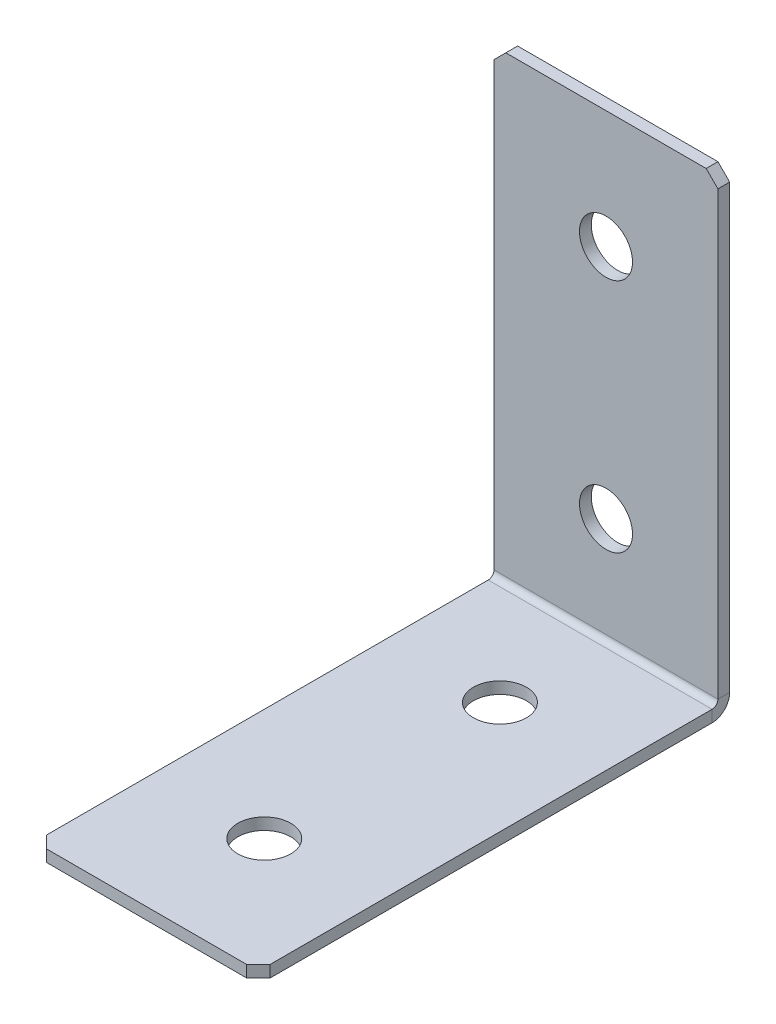
ISO-10303-21;
HEADER;
FILE_DESCRIPTION(('STEP AP214'),'2;1');
FILE_NAME('part.step','',(''),(''),'','','');
FILE_SCHEMA(('AUTOMOTIVE_DESIGN { 1 0 10303 214 1 1 1 1 }'));
ENDSEC;
DATA;
#1=APPLICATION_CONTEXT('core data for automotive mechanical design processes');
#2=APPLICATION_PROTOCOL_DEFINITION('international standard','automotive_design',2000,#1);
#3=PRODUCT_CONTEXT('',#1,'mechanical');
#4=PRODUCT('Part','Part','',(#3));
#5=PRODUCT_RELATED_PRODUCT_CATEGORY('part','',(#4));
#6=PRODUCT_DEFINITION_FORMATION('','',#4);
#7=PRODUCT_DEFINITION_CONTEXT('part definition',#1,'design');
#8=PRODUCT_DEFINITION('design','',#6,#7);
#9=PRODUCT_DEFINITION_SHAPE('','',#8);
#10=(LENGTH_UNIT() NAMED_UNIT(*) SI_UNIT(.MILLI.,.METRE.));
#11=(NAMED_UNIT(*) PLANE_ANGLE_UNIT() SI_UNIT($,.RADIAN.));
#12=(NAMED_UNIT(*) SI_UNIT($,.STERADIAN.) SOLID_ANGLE_UNIT());
#13=UNCERTAINTY_MEASURE_WITH_UNIT(LENGTH_MEASURE(1.E-05),#10,'distance_accuracy_value','');
#14=(GEOMETRIC_REPRESENTATION_CONTEXT(3) GLOBAL_UNCERTAINTY_ASSIGNED_CONTEXT((#13)) GLOBAL_UNIT_ASSIGNED_CONTEXT((#10,
#11,#12)) REPRESENTATION_CONTEXT('',''));
#15=CARTESIAN_POINT('',(0.,0.,0.));
#16=DIRECTION('',(0.,0.,1.));
#17=DIRECTION('',(1.,0.,0.));
#18=AXIS2_PLACEMENT_3D('',#15,#16,#17);
#19=CARTESIAN_POINT('',(0.,0.,2.));
#20=DIRECTION('',(0.,0.,-1.));
#21=DIRECTION('',(-1.,0.,0.));
#22=AXIS2_PLACEMENT_3D('',#19,#20,#21);
#23=PLANE('',#22);
#24=DIRECTION('',(0.,1.,0.));
#25=VECTOR('',#24,1.);
#26=CARTESIAN_POINT('',(19.,0.,2.));
#27=LINE('',#26,#25);
#28=CARTESIAN_POINT('',(19.,3.,2.));
#29=VERTEX_POINT('',#28);
#30=CARTESIAN_POINT('',(19.,78.,2.));
#31=VERTEX_POINT('',#30);
#32=EDGE_CURVE('E252',#29,#31,#27,.T.);
#33=ORIENTED_EDGE('',*,*,#32,.T.);
#34=DIRECTION('',(0.70710678118655,-0.707106781186545,0.));
#35=VECTOR('',#34,1.);
#36=CARTESIAN_POINT('',(19.,78.,2.));
#37=LINE('',#36,#35);
#38=CARTESIAN_POINT('',(17.,80.,2.));
#39=VERTEX_POINT('',#38);
#40=EDGE_CURVE('E301',#31,#39,#37,.F.);
#41=ORIENTED_EDGE('',*,*,#40,.T.);
#42=DIRECTION('',(-1.,0.,0.));
#43=VECTOR('',#42,1.);
#44=CARTESIAN_POINT('',(-19.,80.,2.));
#45=LINE('',#44,#43);
#46=CARTESIAN_POINT('',(-17.,80.,2.));
#47=VERTEX_POINT('',#46);
#48=EDGE_CURVE('E257',#39,#47,#45,.T.);
#49=ORIENTED_EDGE('',*,*,#48,.T.);
#50=DIRECTION('',(0.707106781186545,0.70710678118655,0.));
#51=VECTOR('',#50,1.);
#52=CARTESIAN_POINT('',(-17.,80.,2.));
#53=LINE('',#52,#51);
#54=CARTESIAN_POINT('',(-19.,78.,2.));
#55=VERTEX_POINT('',#54);
#56=EDGE_CURVE('E298',#47,#55,#53,.F.);
#57=ORIENTED_EDGE('',*,*,#56,.T.);
#58=DIRECTION('',(0.,-1.,0.));
#59=VECTOR('',#58,1.);
#60=CARTESIAN_POINT('',(-19.,0.,2.));
#61=LINE('',#60,#59);
#62=CARTESIAN_POINT('',(-19.,3.,2.));
#63=VERTEX_POINT('',#62);
#64=EDGE_CURVE('E249',#55,#63,#61,.T.);
#65=ORIENTED_EDGE('',*,*,#64,.T.);
#66=DIRECTION('',(1.,0.,0.));
#67=VECTOR('',#66,1.);
#68=CARTESIAN_POINT('',(19.,3.,2.));
#69=LINE('',#68,#67);
#70=EDGE_CURVE('E236',#29,#63,#69,.F.);
#71=ORIENTED_EDGE('',*,*,#70,.F.);
#72=EDGE_LOOP('',(#33,#41,#49,#57,#65,#71));
#73=FACE_BOUND('',#72,.T.);
#74=CARTESIAN_POINT('',(0.,60.,2.));
#75=DIRECTION('',(0.,0.,1.));
#76=DIRECTION('',(1.,0.,0.));
#77=AXIS2_PLACEMENT_3D('',#74,#75,#76);
#78=CIRCLE('',#77,4.5);
#79=CARTESIAN_POINT('',(4.5,60.,2.));
#80=VERTEX_POINT('',#79);
#81=EDGE_CURVE('E681',#80,#80,#78,.T.);
#82=ORIENTED_EDGE('',*,*,#81,.F.);
#83=EDGE_LOOP('',(#82));
#84=FACE_BOUND('',#83,.T.);
#85=CARTESIAN_POINT('',(0.,20.,2.));
#86=DIRECTION('',(0.,0.,1.));
#87=DIRECTION('',(1.,0.,0.));
#88=AXIS2_PLACEMENT_3D('',#85,#86,#87);
#89=CIRCLE('',#88,4.5);
#90=CARTESIAN_POINT('',(4.5,20.,2.));
#91=VERTEX_POINT('',#90);
#92=EDGE_CURVE('E664',#91,#91,#89,.T.);
#93=ORIENTED_EDGE('',*,*,#92,.F.);
#94=EDGE_LOOP('',(#93));
#95=FACE_BOUND('',#94,.T.);
#96=ADVANCED_FACE('F68',(#73,#84,#95),#23,.F.);
#97=CARTESIAN_POINT('',(19.,0.,2.));
#98=DIRECTION('',(-1.,0.,0.));
#99=DIRECTION('',(0.,1.,0.));
#100=AXIS2_PLACEMENT_3D('',#97,#98,#99);
#101=PLANE('',#100);
#102=DIRECTION('',(0.,1.,0.));
#103=VECTOR('',#102,1.);
#104=CARTESIAN_POINT('',(19.,0.,0.));
#105=LINE('',#104,#103);
#106=CARTESIAN_POINT('',(19.,3.,0.));
#107=VERTEX_POINT('',#106);
#108=CARTESIAN_POINT('',(19.,78.,0.));
#109=VERTEX_POINT('',#108);
#110=EDGE_CURVE('E264',#107,#109,#105,.T.);
#111=ORIENTED_EDGE('',*,*,#110,.T.);
#112=DIRECTION('',(0.,0.,-1.));
#113=VECTOR('',#112,1.);
#114=CARTESIAN_POINT('',(19.,78.,2.));
#115=LINE('',#114,#113);
#116=EDGE_CURVE('E294',#109,#31,#115,.F.);
#117=ORIENTED_EDGE('',*,*,#116,.T.);
#118=ORIENTED_EDGE('',*,*,#32,.F.);
#119=DIRECTION('',(0.,0.,-1.));
#120=VECTOR('',#119,1.);
#121=CARTESIAN_POINT('',(19.,3.,2.));
#122=LINE('',#121,#120);
#123=EDGE_CURVE('E231',#29,#107,#122,.T.);
#124=ORIENTED_EDGE('',*,*,#123,.T.);
#125=EDGE_LOOP('',(#111,#117,#118,#124));
#126=FACE_BOUND('',#125,.T.);
#127=ADVANCED_FACE('F322',(#126),#101,.F.);
#128=CARTESIAN_POINT('',(0.,0.,0.));
#129=DIRECTION('',(0.,0.,-1.));
#130=DIRECTION('',(-1.,0.,0.));
#131=AXIS2_PLACEMENT_3D('',#128,#129,#130);
#132=PLANE('',#131);
#133=CARTESIAN_POINT('',(0.,20.,0.));
#134=DIRECTION('',(0.,0.,-1.));
#135=DIRECTION('',(-1.,0.,0.));
#136=AXIS2_PLACEMENT_3D('',#133,#134,#135);
#137=CIRCLE('',#136,4.5);
#138=CARTESIAN_POINT('',(-4.5,20.,0.));
#139=VERTEX_POINT('',#138);
#140=EDGE_CURVE('E672',#139,#139,#137,.T.);
#141=ORIENTED_EDGE('',*,*,#140,.F.);
#142=EDGE_LOOP('',(#141));
#143=FACE_BOUND('',#142,.T.);
#144=CARTESIAN_POINT('',(0.,60.,0.));
#145=DIRECTION('',(0.,0.,-1.));
#146=DIRECTION('',(-1.,0.,0.));
#147=AXIS2_PLACEMENT_3D('',#144,#145,#146);
#148=CIRCLE('',#147,4.5);
#149=CARTESIAN_POINT('',(-4.5,60.,0.));
#150=VERTEX_POINT('',#149);
#151=EDGE_CURVE('E226',#150,#150,#148,.T.);
#152=ORIENTED_EDGE('',*,*,#151,.F.);
#153=EDGE_LOOP('',(#152));
#154=FACE_BOUND('',#153,.T.);
#155=DIRECTION('',(-1.,0.,0.));
#156=VECTOR('',#155,1.);
#157=CARTESIAN_POINT('',(0.,80.,0.));
#158=LINE('',#157,#156);
#159=CARTESIAN_POINT('',(17.,80.,0.));
#160=VERTEX_POINT('',#159);
#161=CARTESIAN_POINT('',(-17.,80.,0.));
#162=VERTEX_POINT('',#161);
#163=EDGE_CURVE('E253',#160,#162,#158,.T.);
#164=ORIENTED_EDGE('',*,*,#163,.F.);
#165=DIRECTION('',(-0.70710678118655,0.707106781186545,0.));
#166=VECTOR('',#165,1.);
#167=CARTESIAN_POINT('',(48.4999999999999,48.5000000000003,0.));
#168=LINE('',#167,#166);
#169=EDGE_CURVE('E78',#160,#109,#168,.F.);
#170=ORIENTED_EDGE('',*,*,#169,.T.);
#171=ORIENTED_EDGE('',*,*,#110,.F.);
#172=DIRECTION('',(1.,0.,0.));
#173=VECTOR('',#172,1.);
#174=CARTESIAN_POINT('',(19.,3.,0.));
#175=LINE('',#174,#173);
#176=CARTESIAN_POINT('',(-19.,3.00000000000001,0.));
#177=VERTEX_POINT('',#176);
#178=EDGE_CURVE('E167',#107,#177,#175,.F.);
#179=ORIENTED_EDGE('',*,*,#178,.T.);
#180=DIRECTION('',(0.,1.,0.));
#181=VECTOR('',#180,1.);
#182=CARTESIAN_POINT('',(-19.,0.,0.));
#183=LINE('',#182,#181);
#184=CARTESIAN_POINT('',(-19.,78.,0.));
#185=VERTEX_POINT('',#184);
#186=EDGE_CURVE('E246',#185,#177,#183,.F.);
#187=ORIENTED_EDGE('',*,*,#186,.F.);
#188=DIRECTION('',(-0.707106781186545,-0.70710678118655,0.));
#189=VECTOR('',#188,1.);
#190=CARTESIAN_POINT('',(-48.5,48.4999999999997,0.));
#191=LINE('',#190,#189);
#192=EDGE_CURVE('E90',#185,#162,#191,.F.);
#193=ORIENTED_EDGE('',*,*,#192,.T.);
#194=EDGE_LOOP('',(#164,#170,#171,#179,#187,#193));
#195=FACE_BOUND('',#194,.T.);
#196=ADVANCED_FACE('F317',(#143,#154,#195),#132,.T.);
#197=CARTESIAN_POINT('',(-19.,80.,2.));
#198=DIRECTION('',(0.,-1.,0.));
#199=DIRECTION('',(-1.,0.,0.));
#200=AXIS2_PLACEMENT_3D('',#197,#198,#199);
#201=PLANE('',#200);
#202=ORIENTED_EDGE('',*,*,#48,.F.);
#203=DIRECTION('',(0.,0.,1.));
#204=VECTOR('',#203,1.);
#205=CARTESIAN_POINT('',(17.,80.,2.));
#206=LINE('',#205,#204);
#207=EDGE_CURVE('E308',#39,#160,#206,.F.);
#208=ORIENTED_EDGE('',*,*,#207,.T.);
#209=ORIENTED_EDGE('',*,*,#163,.T.);
#210=DIRECTION('',(0.,0.,-1.));
#211=VECTOR('',#210,1.);
#212=CARTESIAN_POINT('',(-17.,80.,2.));
#213=LINE('',#212,#211);
#214=EDGE_CURVE('E304',#162,#47,#213,.F.);
#215=ORIENTED_EDGE('',*,*,#214,.T.);
#216=EDGE_LOOP('',(#202,#208,#209,#215));
#217=FACE_BOUND('',#216,.T.);
#218=ADVANCED_FACE('F330',(#217),#201,.F.);
#219=CARTESIAN_POINT('',(-19.,0.,2.));
#220=DIRECTION('',(1.,0.,0.));
#221=DIRECTION('',(0.,-1.,0.));
#222=AXIS2_PLACEMENT_3D('',#219,#220,#221);
#223=PLANE('',#222);
#224=ORIENTED_EDGE('',*,*,#64,.F.);
#225=DIRECTION('',(0.,0.,1.));
#226=VECTOR('',#225,1.);
#227=CARTESIAN_POINT('',(-19.,78.,2.));
#228=LINE('',#227,#226);
#229=EDGE_CURVE('E13',#55,#185,#228,.F.);
#230=ORIENTED_EDGE('',*,*,#229,.T.);
#231=ORIENTED_EDGE('',*,*,#186,.T.);
#232=DIRECTION('',(0.,0.,-1.));
#233=VECTOR('',#232,1.);
#234=CARTESIAN_POINT('',(-19.,3.,2.));
#235=LINE('',#234,#233);
#236=EDGE_CURVE('E242',#63,#177,#235,.T.);
#237=ORIENTED_EDGE('',*,*,#236,.F.);
#238=EDGE_LOOP('',(#224,#230,#231,#237));
#239=FACE_BOUND('',#238,.T.);
#240=ADVANCED_FACE('F334',(#239),#223,.F.);
#241=CARTESIAN_POINT('',(-19.,3.,3.));
#242=DIRECTION('',(-1.,0.,0.));
#243=DIRECTION('',(0.,0.,1.));
#244=AXIS2_PLACEMENT_3D('',#241,#242,#243);
#245=PLANE('',#244);
#246=DIRECTION('',(0.,1.,0.));
#247=VECTOR('',#246,1.);
#248=CARTESIAN_POINT('',(-19.,0.,2.99999999999999));
#249=LINE('',#248,#247);
#250=CARTESIAN_POINT('',(-19.,2.,3.));
#251=VERTEX_POINT('',#250);
#252=CARTESIAN_POINT('',(-19.,0.,2.99999999999999));
#253=VERTEX_POINT('',#252);
#254=EDGE_CURVE('E222',#251,#253,#249,.F.);
#255=ORIENTED_EDGE('',*,*,#254,.F.);
#256=CARTESIAN_POINT('',(-19.,3.,3.));
#257=DIRECTION('',(1.,0.,0.));
#258=DIRECTION('',(0.,0.,-1.));
#259=AXIS2_PLACEMENT_3D('',#256,#257,#258);
#260=CIRCLE('',#259,1.);
#261=EDGE_CURVE('E171',#63,#251,#260,.F.);
#262=ORIENTED_EDGE('',*,*,#261,.F.);
#263=ORIENTED_EDGE('',*,*,#236,.T.);
#264=CARTESIAN_POINT('',(-19.,3.,3.));
#265=DIRECTION('',(1.,0.,0.));
#266=DIRECTION('',(0.,0.,-1.));
#267=AXIS2_PLACEMENT_3D('',#264,#265,#266);
#268=CIRCLE('',#267,3.);
#269=EDGE_CURVE('E229',#177,#253,#268,.F.);
#270=ORIENTED_EDGE('',*,*,#269,.T.);
#271=EDGE_LOOP('',(#255,#262,#263,#270));
#272=FACE_BOUND('',#271,.T.);
#273=ADVANCED_FACE('F338',(#272),#245,.T.);
#274=CARTESIAN_POINT('',(19.,3.,3.));
#275=DIRECTION('',(-1.,0.,0.));
#276=DIRECTION('',(0.,0.,1.));
#277=AXIS2_PLACEMENT_3D('',#274,#275,#276);
#278=PLANE('',#277);
#279=CARTESIAN_POINT('',(19.,3.,3.));
#280=DIRECTION('',(1.,0.,0.));
#281=DIRECTION('',(0.,0.,-1.));
#282=AXIS2_PLACEMENT_3D('',#279,#280,#281);
#283=CIRCLE('',#282,1.);
#284=CARTESIAN_POINT('',(19.,2.,3.));
#285=VERTEX_POINT('',#284);
#286=EDGE_CURVE('E178',#285,#29,#283,.T.);
#287=ORIENTED_EDGE('',*,*,#286,.F.);
#288=DIRECTION('',(0.,1.,0.));
#289=VECTOR('',#288,1.);
#290=CARTESIAN_POINT('',(19.,2.,3.));
#291=LINE('',#290,#289);
#292=CARTESIAN_POINT('',(19.,0.,2.99999999999999));
#293=VERTEX_POINT('',#292);
#294=EDGE_CURVE('E175',#285,#293,#291,.F.);
#295=ORIENTED_EDGE('',*,*,#294,.T.);
#296=CARTESIAN_POINT('',(19.,3.,3.));
#297=DIRECTION('',(1.,0.,0.));
#298=DIRECTION('',(0.,0.,-1.));
#299=AXIS2_PLACEMENT_3D('',#296,#297,#298);
#300=CIRCLE('',#299,3.);
#301=EDGE_CURVE('E159',#293,#107,#300,.T.);
#302=ORIENTED_EDGE('',*,*,#301,.T.);
#303=ORIENTED_EDGE('',*,*,#123,.F.);
#304=EDGE_LOOP('',(#287,#295,#302,#303));
#305=FACE_BOUND('',#304,.T.);
#306=ADVANCED_FACE('F176',(#305),#278,.F.);
#307=CARTESIAN_POINT('',(19.,3.,3.));
#308=DIRECTION('',(1.,0.,0.));
#309=DIRECTION('',(0.,-1.,0.));
#310=AXIS2_PLACEMENT_3D('',#307,#308,#309);
#311=CYLINDRICAL_SURFACE('',#310,3.);
#312=ORIENTED_EDGE('',*,*,#178,.F.);
#313=ORIENTED_EDGE('',*,*,#301,.F.);
#314=DIRECTION('',(1.,0.,0.));
#315=VECTOR('',#314,1.);
#316=CARTESIAN_POINT('',(-19.,0.,2.99999999999999));
#317=LINE('',#316,#315);
#318=EDGE_CURVE('E164',#293,#253,#317,.F.);
#319=ORIENTED_EDGE('',*,*,#318,.T.);
#320=ORIENTED_EDGE('',*,*,#269,.F.);
#321=EDGE_LOOP('',(#312,#313,#319,#320));
#322=FACE_BOUND('',#321,.T.);
#323=ADVANCED_FACE('F161',(#322),#311,.T.);
#324=CARTESIAN_POINT('',(19.,3.,3.));
#325=DIRECTION('',(1.,0.,0.));
#326=DIRECTION('',(0.,-1.,0.));
#327=AXIS2_PLACEMENT_3D('',#324,#325,#326);
#328=CYLINDRICAL_SURFACE('',#327,1.);
#329=ORIENTED_EDGE('',*,*,#70,.T.);
#330=ORIENTED_EDGE('',*,*,#261,.T.);
#331=DIRECTION('',(1.,0.,0.));
#332=VECTOR('',#331,1.);
#333=CARTESIAN_POINT('',(-19.,2.,3.));
#334=LINE('',#333,#332);
#335=EDGE_CURVE('E184',#251,#285,#334,.T.);
#336=ORIENTED_EDGE('',*,*,#335,.T.);
#337=ORIENTED_EDGE('',*,*,#286,.T.);
#338=EDGE_LOOP('',(#329,#330,#336,#337));
#339=FACE_BOUND('',#338,.T.);
#340=ADVANCED_FACE('F341',(#339),#328,.F.);
#341=CARTESIAN_POINT('',(-19.,0.,1.99999999999999));
#342=DIRECTION('',(1.,0.,0.));
#343=DIRECTION('',(0.,0.,-1.));
#344=AXIS2_PLACEMENT_3D('',#341,#342,#343);
#345=PLANE('',#344);
#346=DIRECTION('',(0.,0.,-1.));
#347=VECTOR('',#346,1.);
#348=CARTESIAN_POINT('',(-19.,0.,0.));
#349=LINE('',#348,#347);
#350=CARTESIAN_POINT('',(-19.,-2.65396650525857E-13,78.));
#351=VERTEX_POINT('',#350);
#352=EDGE_CURVE('E192',#351,#253,#349,.T.);
#353=ORIENTED_EDGE('',*,*,#352,.F.);
#354=DIRECTION('',(0.,1.,0.));
#355=VECTOR('',#354,1.);
#356=CARTESIAN_POINT('',(-19.,-2.65352581752078E-13,78.));
#357=LINE('',#356,#355);
#358=CARTESIAN_POINT('',(-19.,1.99999999999973,78.));
#359=VERTEX_POINT('',#358);
#360=EDGE_CURVE('E290',#351,#359,#357,.T.);
#361=ORIENTED_EDGE('',*,*,#360,.T.);
#362=DIRECTION('',(0.,0.,1.));
#363=VECTOR('',#362,1.);
#364=CARTESIAN_POINT('',(-19.,2.,2.));
#365=LINE('',#364,#363);
#366=EDGE_CURVE('E194',#359,#251,#365,.F.);
#367=ORIENTED_EDGE('',*,*,#366,.T.);
#368=ORIENTED_EDGE('',*,*,#254,.T.);
#369=EDGE_LOOP('',(#353,#361,#367,#368));
#370=FACE_BOUND('',#369,.T.);
#371=ADVANCED_FACE('F358',(#370),#345,.F.);
#372=CARTESIAN_POINT('',(19.,-2.72351585728359E-13,80.));
#373=DIRECTION('',(-1.,0.,0.));
#374=DIRECTION('',(0.,0.,1.));
#375=AXIS2_PLACEMENT_3D('',#372,#373,#374);
#376=PLANE('',#375);
#377=DIRECTION('',(0.,0.,-1.));
#378=VECTOR('',#377,1.);
#379=CARTESIAN_POINT('',(19.,1.99999999999973,80.));
#380=LINE('',#379,#378);
#381=CARTESIAN_POINT('',(19.,1.99999999999973,78.));
#382=VERTEX_POINT('',#381);
#383=EDGE_CURVE('E215',#285,#382,#380,.F.);
#384=ORIENTED_EDGE('',*,*,#383,.T.);
#385=DIRECTION('',(0.,-1.,0.));
#386=VECTOR('',#385,1.);
#387=CARTESIAN_POINT('',(19.,-2.65368623050672E-13,78.));
#388=LINE('',#387,#386);
#389=CARTESIAN_POINT('',(19.,-2.65396650525857E-13,78.));
#390=VERTEX_POINT('',#389);
#391=EDGE_CURVE('E198',#382,#390,#388,.T.);
#392=ORIENTED_EDGE('',*,*,#391,.T.);
#393=DIRECTION('',(0.,0.,1.));
#394=VECTOR('',#393,1.);
#395=CARTESIAN_POINT('',(19.,0.,0.));
#396=LINE('',#395,#394);
#397=EDGE_CURVE('E189',#293,#390,#396,.T.);
#398=ORIENTED_EDGE('',*,*,#397,.F.);
#399=ORIENTED_EDGE('',*,*,#294,.F.);
#400=EDGE_LOOP('',(#384,#392,#398,#399));
#401=FACE_BOUND('',#400,.T.);
#402=ADVANCED_FACE('F196',(#401),#376,.F.);
#403=CARTESIAN_POINT('',(0.,0.,0.));
#404=DIRECTION('',(0.,1.,0.));
#405=DIRECTION('',(0.,0.,1.));
#406=AXIS2_PLACEMENT_3D('',#403,#404,#405);
#407=PLANE('',#406);
#408=CARTESIAN_POINT('',(0.,0.,20.));
#409=DIRECTION('',(0.,1.,0.));
#410=DIRECTION('',(0.,0.,1.));
#411=AXIS2_PLACEMENT_3D('',#408,#409,#410);
#412=CIRCLE('',#411,4.5);
#413=CARTESIAN_POINT('',(0.,0.,24.5));
#414=VERTEX_POINT('',#413);
#415=EDGE_CURVE('E659',#414,#414,#412,.T.);
#416=ORIENTED_EDGE('',*,*,#415,.T.);
#417=EDGE_LOOP('',(#416));
#418=FACE_BOUND('',#417,.T.);
#419=CARTESIAN_POINT('',(0.,-2.02528965820292E-13,60.));
#420=DIRECTION('',(0.,1.,0.));
#421=DIRECTION('',(0.,0.,1.));
#422=AXIS2_PLACEMENT_3D('',#419,#420,#421);
#423=CIRCLE('',#422,4.5);
#424=CARTESIAN_POINT('',(0.,-2.18240631845086E-13,64.5));
#425=VERTEX_POINT('',#424);
#426=EDGE_CURVE('E662',#425,#425,#423,.T.);
#427=ORIENTED_EDGE('',*,*,#426,.T.);
#428=EDGE_LOOP('',(#427));
#429=FACE_BOUND('',#428,.T.);
#430=ORIENTED_EDGE('',*,*,#397,.T.);
#431=DIRECTION('',(0.707106781186544,0.,-0.707106781186551));
#432=VECTOR('',#431,1.);
#433=CARTESIAN_POINT('',(17.,-2.72351585728359E-13,80.));
#434=LINE('',#433,#432);
#435=CARTESIAN_POINT('',(17.,-2.72379613203543E-13,80.));
#436=VERTEX_POINT('',#435);
#437=EDGE_CURVE('E287',#390,#436,#434,.F.);
#438=ORIENTED_EDGE('',*,*,#437,.T.);
#439=DIRECTION('',(-1.,0.,0.));
#440=VECTOR('',#439,1.);
#441=CARTESIAN_POINT('',(0.,-2.72379613203543E-13,80.));
#442=LINE('',#441,#440);
#443=CARTESIAN_POINT('',(-17.,-2.72379613203543E-13,80.));
#444=VERTEX_POINT('',#443);
#445=EDGE_CURVE('E200',#436,#444,#442,.T.);
#446=ORIENTED_EDGE('',*,*,#445,.T.);
#447=DIRECTION('',(0.70710678118655,0.,0.707106781186545));
#448=VECTOR('',#447,1.);
#449=CARTESIAN_POINT('',(-19.,-2.65352581752078E-13,78.));
#450=LINE('',#449,#448);
#451=EDGE_CURVE('E284',#444,#351,#450,.F.);
#452=ORIENTED_EDGE('',*,*,#451,.T.);
#453=ORIENTED_EDGE('',*,*,#352,.T.);
#454=ORIENTED_EDGE('',*,*,#318,.F.);
#455=EDGE_LOOP('',(#430,#438,#446,#452,#453,#454));
#456=FACE_BOUND('',#455,.T.);
#457=ADVANCED_FACE('F188',(#418,#429,#456),#407,.F.);
#458=CARTESIAN_POINT('',(0.,2.00000000000001,0.));
#459=DIRECTION('',(0.,1.,0.));
#460=DIRECTION('',(0.,0.,1.));
#461=AXIS2_PLACEMENT_3D('',#458,#459,#460);
#462=PLANE('',#461);
#463=CARTESIAN_POINT('',(0.,1.99999999999994,20.));
#464=DIRECTION('',(0.,1.,0.));
#465=DIRECTION('',(0.,0.,1.));
#466=AXIS2_PLACEMENT_3D('',#463,#464,#465);
#467=CIRCLE('',#466,4.5);
#468=CARTESIAN_POINT('',(0.,1.99999999999992,24.5));
#469=VERTEX_POINT('',#468);
#470=EDGE_CURVE('E709',#469,#469,#467,.T.);
#471=ORIENTED_EDGE('',*,*,#470,.F.);
#472=EDGE_LOOP('',(#471));
#473=FACE_BOUND('',#472,.T.);
#474=CARTESIAN_POINT('',(0.,1.9999999999998,60.));
#475=DIRECTION('',(0.,1.,0.));
#476=DIRECTION('',(0.,0.,1.));
#477=AXIS2_PLACEMENT_3D('',#474,#475,#476);
#478=CIRCLE('',#477,4.5);
#479=CARTESIAN_POINT('',(0.,1.99999999999978,64.5));
#480=VERTEX_POINT('',#479);
#481=EDGE_CURVE('E665',#480,#480,#478,.T.);
#482=ORIENTED_EDGE('',*,*,#481,.F.);
#483=EDGE_LOOP('',(#482));
#484=FACE_BOUND('',#483,.T.);
#485=DIRECTION('',(1.,0.,0.));
#486=VECTOR('',#485,1.);
#487=CARTESIAN_POINT('',(-19.,1.99999999999973,80.));
#488=LINE('',#487,#486);
#489=CARTESIAN_POINT('',(17.,1.99999999999973,80.));
#490=VERTEX_POINT('',#489);
#491=CARTESIAN_POINT('',(-17.,1.99999999999973,80.));
#492=VERTEX_POINT('',#491);
#493=EDGE_CURVE('E208',#490,#492,#488,.F.);
#494=ORIENTED_EDGE('',*,*,#493,.F.);
#495=DIRECTION('',(-0.707106781186544,0.,0.707106781186551));
#496=VECTOR('',#495,1.);
#497=CARTESIAN_POINT('',(48.5000000000001,1.99999999999984,48.4999999999997));
#498=LINE('',#497,#496);
#499=EDGE_CURVE('E279',#490,#382,#498,.F.);
#500=ORIENTED_EDGE('',*,*,#499,.T.);
#501=ORIENTED_EDGE('',*,*,#383,.F.);
#502=ORIENTED_EDGE('',*,*,#335,.F.);
#503=ORIENTED_EDGE('',*,*,#366,.F.);
#504=DIRECTION('',(-0.70710678118655,0.,-0.707106781186545));
#505=VECTOR('',#504,1.);
#506=CARTESIAN_POINT('',(-48.4999999999999,1.99999999999984,48.5000000000003));
#507=LINE('',#506,#505);
#508=EDGE_CURVE('E276',#359,#492,#507,.F.);
#509=ORIENTED_EDGE('',*,*,#508,.T.);
#510=EDGE_LOOP('',(#494,#500,#501,#502,#503,#509));
#511=FACE_BOUND('',#510,.T.);
#512=ADVANCED_FACE('F345',(#473,#484,#511),#462,.T.);
#513=CARTESIAN_POINT('',(-19.,-2.72351585728359E-13,80.));
#514=DIRECTION('',(0.,0.,-1.));
#515=DIRECTION('',(0.,1.,0.));
#516=AXIS2_PLACEMENT_3D('',#513,#514,#515);
#517=PLANE('',#516);
#518=ORIENTED_EDGE('',*,*,#445,.F.);
#519=DIRECTION('',(0.,1.,0.));
#520=VECTOR('',#519,1.);
#521=CARTESIAN_POINT('',(17.,-2.72351585728359E-13,80.));
#522=LINE('',#521,#520);
#523=EDGE_CURVE('E272',#436,#490,#522,.T.);
#524=ORIENTED_EDGE('',*,*,#523,.T.);
#525=ORIENTED_EDGE('',*,*,#493,.T.);
#526=DIRECTION('',(0.,-1.,0.));
#527=VECTOR('',#526,1.);
#528=CARTESIAN_POINT('',(-17.,-2.72351585728359E-13,80.));
#529=LINE('',#528,#527);
#530=EDGE_CURVE('E261',#492,#444,#529,.T.);
#531=ORIENTED_EDGE('',*,*,#530,.T.);
#532=EDGE_LOOP('',(#518,#524,#525,#531));
#533=FACE_BOUND('',#532,.T.);
#534=ADVANCED_FACE('F352',(#533),#517,.F.);
#535=CARTESIAN_POINT('',(0.,60.,2.));
#536=DIRECTION('',(0.,0.,1.));
#537=DIRECTION('',(1.,0.,0.));
#538=AXIS2_PLACEMENT_3D('',#535,#536,#537);
#539=CYLINDRICAL_SURFACE('',#538,4.5);
#540=ORIENTED_EDGE('',*,*,#81,.T.);
#541=EDGE_LOOP('',(#540));
#542=FACE_BOUND('',#541,.T.);
#543=ORIENTED_EDGE('',*,*,#151,.T.);
#544=EDGE_LOOP('',(#543));
#545=FACE_BOUND('',#544,.T.);
#546=ADVANCED_FACE('F442',(#542,#545),#539,.F.);
#547=CARTESIAN_POINT('',(0.,20.,2.));
#548=DIRECTION('',(0.,0.,1.));
#549=DIRECTION('',(1.,0.,0.));
#550=AXIS2_PLACEMENT_3D('',#547,#548,#549);
#551=CYLINDRICAL_SURFACE('',#550,4.5);
#552=ORIENTED_EDGE('',*,*,#92,.T.);
#553=EDGE_LOOP('',(#552));
#554=FACE_BOUND('',#553,.T.);
#555=ORIENTED_EDGE('',*,*,#140,.T.);
#556=EDGE_LOOP('',(#555));
#557=FACE_BOUND('',#556,.T.);
#558=ADVANCED_FACE('F433',(#554,#557),#551,.F.);
#559=CARTESIAN_POINT('',(0.,1.9999999999998,60.));
#560=DIRECTION('',(0.,1.,0.));
#561=DIRECTION('',(0.,0.,1.));
#562=AXIS2_PLACEMENT_3D('',#559,#560,#561);
#563=CYLINDRICAL_SURFACE('',#562,4.5);
#564=ORIENTED_EDGE('',*,*,#426,.F.);
#565=EDGE_LOOP('',(#564));
#566=FACE_BOUND('',#565,.T.);
#567=ORIENTED_EDGE('',*,*,#481,.T.);
#568=EDGE_LOOP('',(#567));
#569=FACE_BOUND('',#568,.T.);
#570=ADVANCED_FACE('F424',(#566,#569),#563,.F.);
#571=CARTESIAN_POINT('',(0.,1.99999999999994,20.));
#572=DIRECTION('',(0.,1.,0.));
#573=DIRECTION('',(0.,0.,1.));
#574=AXIS2_PLACEMENT_3D('',#571,#572,#573);
#575=CYLINDRICAL_SURFACE('',#574,4.5);
#576=ORIENTED_EDGE('',*,*,#415,.F.);
#577=EDGE_LOOP('',(#576));
#578=FACE_BOUND('',#577,.T.);
#579=ORIENTED_EDGE('',*,*,#470,.T.);
#580=EDGE_LOOP('',(#579));
#581=FACE_BOUND('',#580,.T.);
#582=ADVANCED_FACE('F390',(#578,#581),#575,.F.);
#583=CARTESIAN_POINT('',(17.,-2.72351585728359E-13,80.));
#584=DIRECTION('',(-0.707106781186551,0.,-0.707106781186544));
#585=DIRECTION('',(0.,1.,0.));
#586=AXIS2_PLACEMENT_3D('',#583,#584,#585);
#587=PLANE('',#586);
#588=ORIENTED_EDGE('',*,*,#437,.F.);
#589=ORIENTED_EDGE('',*,*,#391,.F.);
#590=ORIENTED_EDGE('',*,*,#499,.F.);
#591=ORIENTED_EDGE('',*,*,#523,.F.);
#592=EDGE_LOOP('',(#588,#589,#590,#591));
#593=FACE_BOUND('',#592,.T.);
#594=ADVANCED_FACE('F347',(#593),#587,.F.);
#595=CARTESIAN_POINT('',(-19.,-2.65352581752078E-13,78.));
#596=DIRECTION('',(0.707106781186545,0.,-0.70710678118655));
#597=DIRECTION('',(0.,1.,0.));
#598=AXIS2_PLACEMENT_3D('',#595,#596,#597);
#599=PLANE('',#598);
#600=ORIENTED_EDGE('',*,*,#451,.F.);
#601=ORIENTED_EDGE('',*,*,#530,.F.);
#602=ORIENTED_EDGE('',*,*,#508,.F.);
#603=ORIENTED_EDGE('',*,*,#360,.F.);
#604=EDGE_LOOP('',(#600,#601,#602,#603));
#605=FACE_BOUND('',#604,.T.);
#606=ADVANCED_FACE('F355',(#605),#599,.F.);
#607=CARTESIAN_POINT('',(19.,78.,2.));
#608=DIRECTION('',(-0.707106781186545,-0.70710678118655,0.));
#609=DIRECTION('',(0.,0.,1.));
#610=AXIS2_PLACEMENT_3D('',#607,#608,#609);
#611=PLANE('',#610);
#612=ORIENTED_EDGE('',*,*,#169,.F.);
#613=ORIENTED_EDGE('',*,*,#207,.F.);
#614=ORIENTED_EDGE('',*,*,#40,.F.);
#615=ORIENTED_EDGE('',*,*,#116,.F.);
#616=EDGE_LOOP('',(#612,#613,#614,#615));
#617=FACE_BOUND('',#616,.T.);
#618=ADVANCED_FACE('F324',(#617),#611,.F.);
#619=CARTESIAN_POINT('',(-17.,80.,2.));
#620=DIRECTION('',(0.70710678118655,-0.707106781186545,0.));
#621=DIRECTION('',(0.,0.,1.));
#622=AXIS2_PLACEMENT_3D('',#619,#620,#621);
#623=PLANE('',#622);
#624=ORIENTED_EDGE('',*,*,#192,.F.);
#625=ORIENTED_EDGE('',*,*,#229,.F.);
#626=ORIENTED_EDGE('',*,*,#56,.F.);
#627=ORIENTED_EDGE('',*,*,#214,.F.);
#628=EDGE_LOOP('',(#624,#625,#626,#627));
#629=FACE_BOUND('',#628,.T.);
#630=ADVANCED_FACE('F71',(#629),#623,.F.);
#631=CLOSED_SHELL('',(#96,#127,#196,#218,#240,#273,#306,#323,#340,#371,#402,#457,#512,#534,#546,
#558,#570,#582,#594,#606,#618,#630));
#632=MANIFOLD_SOLID_BREP('B2',#631);
#633=ADVANCED_BREP_SHAPE_REPRESENTATION('',(#18,#632),#14);
#634=SHAPE_DEFINITION_REPRESENTATION(#9,#633);
ENDSEC;
END-ISO-10303-21;
